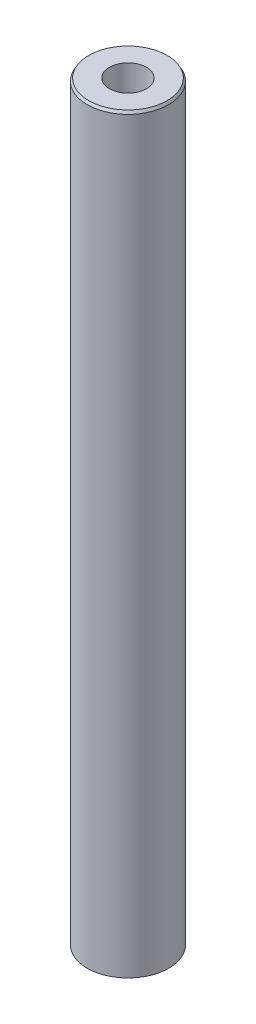
ISO-10303-21;
HEADER;
FILE_DESCRIPTION(('STEP AP214'),'2;1');
FILE_NAME('part.step','',(''),(''),'','','');
FILE_SCHEMA(('AUTOMOTIVE_DESIGN { 1 0 10303 214 1 1 1 1 }'));
ENDSEC;
DATA;
#1=APPLICATION_CONTEXT('core data for automotive mechanical design processes');
#2=APPLICATION_PROTOCOL_DEFINITION('international standard','automotive_design',2000,#1);
#3=PRODUCT_CONTEXT('',#1,'mechanical');
#4=PRODUCT('Part','Part','',(#3));
#5=PRODUCT_RELATED_PRODUCT_CATEGORY('part','',(#4));
#6=PRODUCT_DEFINITION_FORMATION('','',#4);
#7=PRODUCT_DEFINITION_CONTEXT('part definition',#1,'design');
#8=PRODUCT_DEFINITION('design','',#6,#7);
#9=PRODUCT_DEFINITION_SHAPE('','',#8);
#10=(LENGTH_UNIT() NAMED_UNIT(*) SI_UNIT(.MILLI.,.METRE.));
#11=(NAMED_UNIT(*) PLANE_ANGLE_UNIT() SI_UNIT($,.RADIAN.));
#12=(NAMED_UNIT(*) SI_UNIT($,.STERADIAN.) SOLID_ANGLE_UNIT());
#13=UNCERTAINTY_MEASURE_WITH_UNIT(LENGTH_MEASURE(1.E-05),#10,'distance_accuracy_value','');
#14=(GEOMETRIC_REPRESENTATION_CONTEXT(3) GLOBAL_UNCERTAINTY_ASSIGNED_CONTEXT((#13)) GLOBAL_UNIT_ASSIGNED_CONTEXT((#10,
#11,#12)) REPRESENTATION_CONTEXT('',''));
#15=CARTESIAN_POINT('',(0.,0.,0.));
#16=DIRECTION('',(0.,0.,1.));
#17=DIRECTION('',(1.,0.,0.));
#18=AXIS2_PLACEMENT_3D('',#15,#16,#17);
#19=CARTESIAN_POINT('',(0.,600.,0.));
#20=DIRECTION('',(0.,-1.,0.));
#21=DIRECTION('',(0.,0.,-1.));
#22=AXIS2_PLACEMENT_3D('',#19,#20,#21);
#23=CYLINDRICAL_SURFACE('',#22,32.5);
#24=CARTESIAN_POINT('',(0.,597.817952398237,0.));
#25=DIRECTION('',(0.,1.,0.));
#26=DIRECTION('',(0.,0.,1.));
#27=AXIS2_PLACEMENT_3D('',#24,#25,#26);
#28=CIRCLE('',#27,32.5);
#29=CARTESIAN_POINT('',(0.,597.817952398237,32.5));
#30=VERTEX_POINT('',#29);
#31=EDGE_CURVE('E50',#30,#30,#28,.F.);
#32=ORIENTED_EDGE('',*,*,#31,.T.);
#33=EDGE_LOOP('',(#32));
#34=FACE_BOUND('',#33,.T.);
#35=CARTESIAN_POINT('',(0.,1.23958874351315,0.));
#36=DIRECTION('',(0.,1.,0.));
#37=DIRECTION('',(0.,0.,1.));
#38=AXIS2_PLACEMENT_3D('',#35,#36,#37);
#39=CIRCLE('',#38,32.5);
#40=CARTESIAN_POINT('',(0.,1.23958874351315,32.5));
#41=VERTEX_POINT('',#40);
#42=EDGE_CURVE('E51',#41,#41,#39,.T.);
#43=ORIENTED_EDGE('',*,*,#42,.T.);
#44=EDGE_LOOP('',(#43));
#45=FACE_BOUND('',#44,.T.);
#46=ADVANCED_FACE('F39',(#34,#45),#23,.T.);
#47=CARTESIAN_POINT('',(0.,600.,0.));
#48=DIRECTION('',(0.,1.,0.));
#49=DIRECTION('',(0.,0.,1.));
#50=AXIS2_PLACEMENT_3D('',#47,#48,#49);
#51=PLANE('',#50);
#52=CARTESIAN_POINT('',(0.,600.,0.));
#53=DIRECTION('',(0.,1.,0.));
#54=DIRECTION('',(0.,0.,1.));
#55=AXIS2_PLACEMENT_3D('',#52,#53,#54);
#56=CIRCLE('',#55,31.2604112564868);
#57=CARTESIAN_POINT('',(0.,600.,31.2604112564868));
#58=VERTEX_POINT('',#57);
#59=EDGE_CURVE('E54',#58,#58,#56,.T.);
#60=ORIENTED_EDGE('',*,*,#59,.T.);
#61=EDGE_LOOP('',(#60));
#62=FACE_BOUND('',#61,.T.);
#63=CARTESIAN_POINT('',(0.,600.,0.));
#64=DIRECTION('',(0.,1.,0.));
#65=DIRECTION('',(0.,0.,1.));
#66=AXIS2_PLACEMENT_3D('',#63,#64,#65);
#67=CIRCLE('',#66,14.802249082169);
#68=CARTESIAN_POINT('',(0.,600.,14.802249082169));
#69=VERTEX_POINT('',#68);
#70=EDGE_CURVE('E58',#69,#69,#67,.T.);
#71=ORIENTED_EDGE('',*,*,#70,.F.);
#72=EDGE_LOOP('',(#71));
#73=FACE_BOUND('',#72,.T.);
#74=ADVANCED_FACE('F69',(#62,#73),#51,.T.);
#75=CARTESIAN_POINT('',(0.,0.,0.));
#76=DIRECTION('',(0.,1.,0.));
#77=DIRECTION('',(0.,0.,1.));
#78=AXIS2_PLACEMENT_3D('',#75,#76,#77);
#79=PLANE('',#78);
#80=CARTESIAN_POINT('',(0.,0.,0.));
#81=DIRECTION('',(0.,1.,0.));
#82=DIRECTION('',(0.,0.,1.));
#83=AXIS2_PLACEMENT_3D('',#80,#81,#82);
#84=CIRCLE('',#83,30.317952398237);
#85=CARTESIAN_POINT('',(0.,0.,30.317952398237));
#86=VERTEX_POINT('',#85);
#87=EDGE_CURVE('E10',#86,#86,#84,.F.);
#88=ORIENTED_EDGE('',*,*,#87,.T.);
#89=EDGE_LOOP('',(#88));
#90=FACE_BOUND('',#89,.T.);
#91=CARTESIAN_POINT('',(0.,0.,0.));
#92=DIRECTION('',(0.,1.,0.));
#93=DIRECTION('',(0.,0.,1.));
#94=AXIS2_PLACEMENT_3D('',#91,#92,#93);
#95=CIRCLE('',#94,14.802249082169);
#96=CARTESIAN_POINT('',(0.,0.,14.802249082169));
#97=VERTEX_POINT('',#96);
#98=EDGE_CURVE('E63',#97,#97,#95,.T.);
#99=ORIENTED_EDGE('',*,*,#98,.T.);
#100=EDGE_LOOP('',(#99));
#101=FACE_BOUND('',#100,.T.);
#102=ADVANCED_FACE('F75',(#90,#101),#79,.F.);
#103=CARTESIAN_POINT('',(0.,600.,0.));
#104=DIRECTION('',(0.,-1.,0.));
#105=DIRECTION('',(0.,0.,-1.));
#106=AXIS2_PLACEMENT_3D('',#103,#104,#105);
#107=CYLINDRICAL_SURFACE('',#106,14.802249082169);
#108=ORIENTED_EDGE('',*,*,#70,.T.);
#109=EDGE_LOOP('',(#108));
#110=FACE_BOUND('',#109,.T.);
#111=ORIENTED_EDGE('',*,*,#98,.F.);
#112=EDGE_LOOP('',(#111));
#113=FACE_BOUND('',#112,.T.);
#114=ADVANCED_FACE('F70',(#110,#113),#107,.F.);
#115=CARTESIAN_POINT('',(0.,600.,0.));
#116=DIRECTION('',(0.,-1.,0.));
#117=DIRECTION('',(0.,0.,-1.));
#118=AXIS2_PLACEMENT_3D('',#115,#116,#117);
#119=CONICAL_SURFACE('',#118,31.2604112564868,0.516622025824101);
#120=ORIENTED_EDGE('',*,*,#31,.F.);
#121=EDGE_LOOP('',(#120));
#122=FACE_BOUND('',#121,.T.);
#123=ORIENTED_EDGE('',*,*,#59,.F.);
#124=EDGE_LOOP('',(#123));
#125=FACE_BOUND('',#124,.T.);
#126=ADVANCED_FACE('F81',(#122,#125),#119,.T.);
#127=CARTESIAN_POINT('',(0.,1.23958874351315,0.));
#128=DIRECTION('',(0.,1.,0.));
#129=DIRECTION('',(0.,0.,1.));
#130=AXIS2_PLACEMENT_3D('',#127,#128,#129);
#131=CONICAL_SURFACE('',#130,32.5,1.05417430097079);
#132=ORIENTED_EDGE('',*,*,#87,.F.);
#133=EDGE_LOOP('',(#132));
#134=FACE_BOUND('',#133,.T.);
#135=ORIENTED_EDGE('',*,*,#42,.F.);
#136=EDGE_LOOP('',(#135));
#137=FACE_BOUND('',#136,.T.);
#138=ADVANCED_FACE('F45',(#134,#137),#131,.T.);
#139=CLOSED_SHELL('',(#46,#74,#102,#114,#126,#138));
#140=MANIFOLD_SOLID_BREP('B2',#139);
#141=ADVANCED_BREP_SHAPE_REPRESENTATION('',(#18,#140),#14);
#142=SHAPE_DEFINITION_REPRESENTATION(#9,#141);
ENDSEC;
END-ISO-10303-21;
